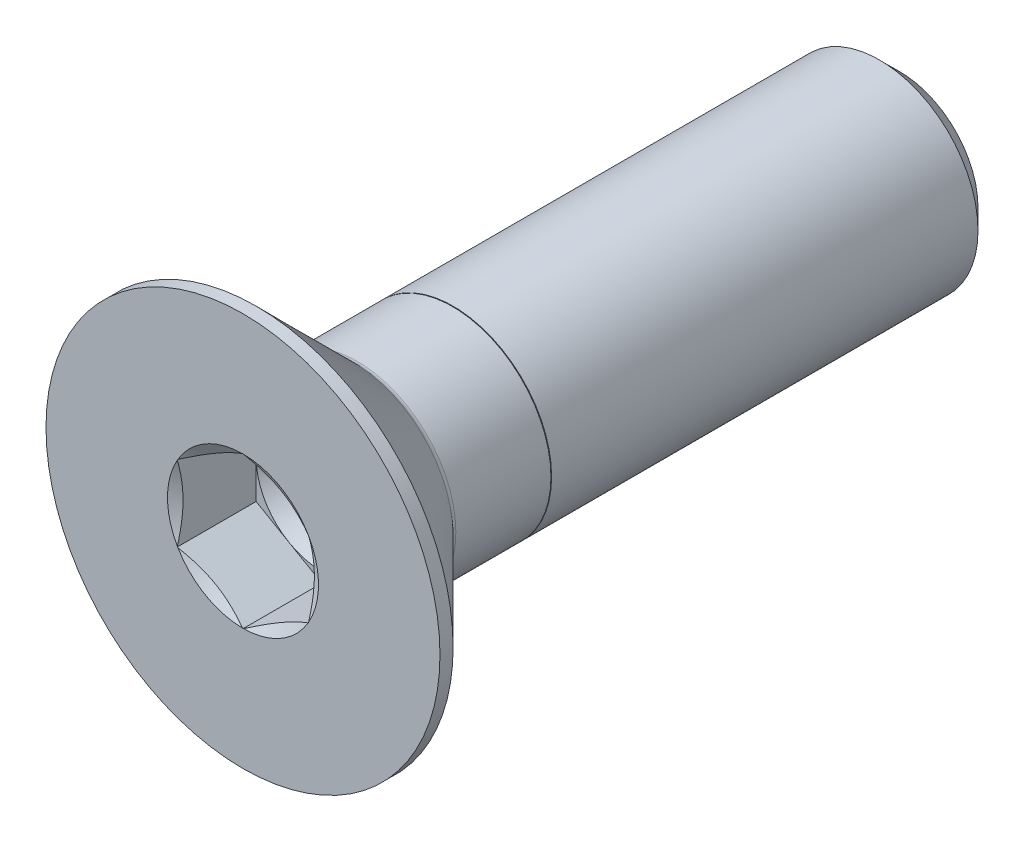
ISO-10303-21;
HEADER;
FILE_DESCRIPTION(('STEP AP214'),'2;1');
FILE_NAME('part.step','',(''),(''),'','','');
FILE_SCHEMA(('AUTOMOTIVE_DESIGN { 1 0 10303 214 1 1 1 1 }'));
ENDSEC;
DATA;
#1=APPLICATION_CONTEXT('core data for automotive mechanical design processes');
#2=APPLICATION_PROTOCOL_DEFINITION('international standard','automotive_design',2000,#1);
#3=PRODUCT_CONTEXT('',#1,'mechanical');
#4=PRODUCT('Part','Part','',(#3));
#5=PRODUCT_RELATED_PRODUCT_CATEGORY('part','',(#4));
#6=PRODUCT_DEFINITION_FORMATION('','',#4);
#7=PRODUCT_DEFINITION_CONTEXT('part definition',#1,'design');
#8=PRODUCT_DEFINITION('design','',#6,#7);
#9=PRODUCT_DEFINITION_SHAPE('','',#8);
#10=(LENGTH_UNIT() NAMED_UNIT(*) SI_UNIT(.MILLI.,.METRE.));
#11=(NAMED_UNIT(*) PLANE_ANGLE_UNIT() SI_UNIT($,.RADIAN.));
#12=(NAMED_UNIT(*) SI_UNIT($,.STERADIAN.) SOLID_ANGLE_UNIT());
#13=UNCERTAINTY_MEASURE_WITH_UNIT(LENGTH_MEASURE(1.E-05),#10,'distance_accuracy_value','');
#14=(GEOMETRIC_REPRESENTATION_CONTEXT(3) GLOBAL_UNCERTAINTY_ASSIGNED_CONTEXT((#13)) GLOBAL_UNIT_ASSIGNED_CONTEXT((#10,
#11,#12)) REPRESENTATION_CONTEXT('',''));
#15=CARTESIAN_POINT('',(0.,0.,0.));
#16=DIRECTION('',(0.,0.,1.));
#17=DIRECTION('',(1.,0.,0.));
#18=AXIS2_PLACEMENT_3D('',#15,#16,#17);
#19=CARTESIAN_POINT('',(0.,0.,1.25));
#20=DIRECTION('',(-1.,0.,0.));
#21=DIRECTION('',(0.,1.,0.));
#22=AXIS2_PLACEMENT_3D('',#19,#20,#21);
#23=SPHERICAL_SURFACE('',#22,1.25);
#24=CARTESIAN_POINT('',(-1.,0.,0.5));
#25=CARTESIAN_POINT('',(-0.999999918221247,-0.0281495245521416,0.5));
#26=CARTESIAN_POINT('',(-0.998810705131522,-0.0562856859630076,0.5));
#27=CARTESIAN_POINT('',(-0.994066576687322,-0.112356361404446,0.5));
#28=CARTESIAN_POINT('',(-0.990511783141581,-0.140290885742875,0.5));
#29=CARTESIAN_POINT('',(-0.976343201238138,-0.223384369013001,0.5));
#30=CARTESIAN_POINT('',(-0.962225042161326,-0.27798690137359,0.5));
#31=CARTESIAN_POINT('',(-0.925017617018385,-0.384066836858397,0.5));
#32=CARTESIAN_POINT('',(-0.901921159244324,-0.435541696368237,0.5));
#33=CARTESIAN_POINT('',(-0.847420007360541,-0.533893955867315,0.5));
#34=CARTESIAN_POINT('',(-0.816013396339763,-0.580770291686499,0.5));
#35=CARTESIAN_POINT('',(-0.742139756291213,-0.673099775905201,0.5));
#36=CARTESIAN_POINT('',(-0.698870858918713,-0.717918970422269,0.5));
#37=CARTESIAN_POINT('',(-0.628318945194335,-0.778580151446536,0.5));
#38=CARTESIAN_POINT('',(-0.603808211615082,-0.797736065958106,0.5));
#39=CARTESIAN_POINT('',(-0.553112162603095,-0.833685170069625,0.5));
#40=CARTESIAN_POINT('',(-0.526926888504461,-0.850478417956551,0.5));
#41=CARTESIAN_POINT('',(-0.5,-0.866025403784439,0.5));
#42=B_SPLINE_CURVE_WITH_KNOTS('',3,(#24,#25,#26,#27,#28,#29,#30,#31,#32,#33,#34,#35,#36,#37,#38,
#39,#40,#41),.UNSPECIFIED.,.F.,.F.,(4,2,2,2,2,2,2,2,4),(0.,0.0843969221510993,0.168789498862693,
0.337119537320777,0.505584688602224,0.674088733831015,0.859796862820128,0.953005960941174,
1.04621275919071),.UNSPECIFIED.);
#43=CARTESIAN_POINT('',(-1.,0.,0.5));
#44=VERTEX_POINT('',#43);
#45=CARTESIAN_POINT('',(-0.5,-0.866025403784438,0.5));
#46=VERTEX_POINT('',#45);
#47=EDGE_CURVE('E21',#44,#46,#42,.T.);
#48=ORIENTED_EDGE('',*,*,#47,.T.);
#49=CARTESIAN_POINT('',(-0.5,-0.866025403784439,0.5));
#50=CARTESIAN_POINT('',(-0.475621755744015,-0.880100095238032,0.5));
#51=CARTESIAN_POINT('',(-0.450660518652364,-0.89313828719725,0.5));
#52=CARTESIAN_POINT('',(-0.399729825090627,-0.917065089166476,0.5));
#53=CARTESIAN_POINT('',(-0.373760420598042,-0.927953809819869,0.5));
#54=CARTESIAN_POINT('',(-0.294715062245455,-0.95723019959095,0.500000000000001));
#55=CARTESIAN_POINT('',(-0.240368802571818,-0.972304781356058,0.500000000000003));
#56=CARTESIAN_POINT('',(-0.129897171038692,-0.993122173715266,0.500000000000003));
#57=CARTESIAN_POINT('',(-0.0737704061599044,-0.998857484300414,0.500000000000001));
#58=CARTESIAN_POINT('',(0.0386557250277878,-1.00083423198308,0.499999999999999));
#59=CARTESIAN_POINT('',(0.094955128193921,-0.997073476901905,0.500000000000001));
#60=CARTESIAN_POINT('',(0.211851627069907,-0.979261770059184,0.500000000000001));
#61=CARTESIAN_POINT('',(0.272300636785095,-0.964199402999392,0.5));
#62=CARTESIAN_POINT('',(0.360110717437866,-0.933430243940605,0.5));
#63=CARTESIAN_POINT('',(0.388955592827236,-0.921781283251364,0.5));
#64=CARTESIAN_POINT('',(0.445436454737096,-0.895851768991243,0.5));
#65=CARTESIAN_POINT('',(0.473072471068542,-0.881571280360231,0.500000000000001));
#66=CARTESIAN_POINT('',(0.500000000000001,-0.866025403784441,0.500000000000003));
#67=B_SPLINE_CURVE_WITH_KNOTS('',3,(#49,#50,#51,#52,#53,#54,#55,#56,#57,#58,#59,#60,#61,#62,#63,
#64,#65,#66),.UNSPECIFIED.,.F.,.F.,(4,2,2,2,2,2,2,2,4),(0.,0.0843969221510981,0.168789498862691,
0.337119537320774,0.50558468860222,0.674088733831011,0.859796862820125,0.953005960941173,
1.04621275919071),.UNSPECIFIED.);
#68=CARTESIAN_POINT('',(0.5,-0.866025403784439,0.5));
#69=VERTEX_POINT('',#68);
#70=EDGE_CURVE('E923',#46,#69,#67,.T.);
#71=ORIENTED_EDGE('',*,*,#70,.T.);
#72=CARTESIAN_POINT('',(0.5,-0.866025403784439,0.5));
#73=CARTESIAN_POINT('',(0.524378162477232,-0.851950570685891,0.5));
#74=CARTESIAN_POINT('',(0.548150186479159,-0.836852601234242,0.5));
#75=CARTESIAN_POINT('',(0.594336751596697,-0.80470872776203,0.5));
#76=CARTESIAN_POINT('',(0.61675136254354,-0.787662924076995,0.5));
#77=CARTESIAN_POINT('',(0.681628138992685,-0.73384583057795,0.5));
#78=CARTESIAN_POINT('',(0.721856239589512,-0.694317879982466,0.500000000000001));
#79=CARTESIAN_POINT('',(0.795120445979699,-0.609055336856868,0.500000000000001));
#80=CARTESIAN_POINT('',(0.828150753084425,-0.563315787932176,0.5));
#81=CARTESIAN_POINT('',(0.886075732388333,-0.466940276115767,0.5));
#82=CARTESIAN_POINT('',(0.910968524533688,-0.416303185215404,0.5));
#83=CARTESIAN_POINT('',(0.953991383361123,-0.306161994153981,0.5));
#84=CARTESIAN_POINT('',(0.971171495703811,-0.246280432577121,0.5));
#85=CARTESIAN_POINT('',(0.988429662632203,-0.154850092494069,0.5));
#86=CARTESIAN_POINT('',(0.992763804442319,-0.124045217293258,0.5));
#87=CARTESIAN_POINT('',(0.998548617340193,-0.0621665989216179,0.5));
#88=CARTESIAN_POINT('',(0.999999359573003,-0.0310928624036789,0.5));
#89=CARTESIAN_POINT('',(1.,0.,0.5));
#90=B_SPLINE_CURVE_WITH_KNOTS('',3,(#72,#73,#74,#75,#76,#77,#78,#79,#80,#81,#82,#83,#84,#85,#86,
#87,#88,#89),.UNSPECIFIED.,.F.,.F.,(4,2,2,2,2,2,2,2,4),(0.,0.0843969221510994,0.168789498862694,
0.337119537320778,0.505584688602225,0.674088733831016,0.859796862820128,0.953005960941174,
1.04621275919071),.UNSPECIFIED.);
#91=CARTESIAN_POINT('',(1.,0.,0.5));
#92=VERTEX_POINT('',#91);
#93=EDGE_CURVE('E928',#69,#92,#90,.T.);
#94=ORIENTED_EDGE('',*,*,#93,.T.);
#95=CARTESIAN_POINT('',(1.,0.,0.5));
#96=CARTESIAN_POINT('',(0.999999918221247,0.0281495245521418,0.5));
#97=CARTESIAN_POINT('',(0.998810705131522,0.0562856859630077,0.5));
#98=CARTESIAN_POINT('',(0.994066576687322,0.112356361404446,0.5));
#99=CARTESIAN_POINT('',(0.990511783141581,0.140290885742875,0.5));
#100=CARTESIAN_POINT('',(0.976343201238138,0.223384369013001,0.5));
#101=CARTESIAN_POINT('',(0.962225042161326,0.27798690137359,0.5));
#102=CARTESIAN_POINT('',(0.925017617018385,0.384066836858397,0.5));
#103=CARTESIAN_POINT('',(0.901921159244324,0.435541696368237,0.5));
#104=CARTESIAN_POINT('',(0.847420007360541,0.533893955867315,0.5));
#105=CARTESIAN_POINT('',(0.816013396339763,0.580770291686499,0.5));
#106=CARTESIAN_POINT('',(0.742139756291213,0.673099775905201,0.5));
#107=CARTESIAN_POINT('',(0.698870858918713,0.717918970422269,0.5));
#108=CARTESIAN_POINT('',(0.628318945194336,0.778580151446535,0.5));
#109=CARTESIAN_POINT('',(0.603808211615082,0.797736065958105,0.5));
#110=CARTESIAN_POINT('',(0.553112162603096,0.833685170069624,0.5));
#111=CARTESIAN_POINT('',(0.526926888504462,0.850478417956551,0.5));
#112=CARTESIAN_POINT('',(0.5,0.866025403784439,0.5));
#113=B_SPLINE_CURVE_WITH_KNOTS('',3,(#95,#96,#97,#98,#99,#100,#101,#102,#103,#104,#105,#106,
#107,#108,#109,#110,#111,#112),.UNSPECIFIED.,.F.,.F.,(4,2,2,2,2,2,2,2,4),(0.,0.0843969221510991,
0.168789498862693,0.337119537320777,0.505584688602224,0.674088733831015,0.859796862820127,
0.953005960941174,1.04621275919071),.UNSPECIFIED.);
#114=CARTESIAN_POINT('',(0.5,0.866025403784438,0.5));
#115=VERTEX_POINT('',#114);
#116=EDGE_CURVE('E384',#92,#115,#113,.T.);
#117=ORIENTED_EDGE('',*,*,#116,.T.);
#118=CARTESIAN_POINT('',(0.5,0.866025403784439,0.5));
#119=CARTESIAN_POINT('',(0.475621755744015,0.880100095238032,0.5));
#120=CARTESIAN_POINT('',(0.450660518652364,0.89313828719725,0.5));
#121=CARTESIAN_POINT('',(0.399729825090626,0.917065089166476,0.5));
#122=CARTESIAN_POINT('',(0.373760420598042,0.927953809819869,0.5));
#123=CARTESIAN_POINT('',(0.294715062245455,0.95723019959095,0.500000000000001));
#124=CARTESIAN_POINT('',(0.240368802571818,0.972304781356058,0.500000000000003));
#125=CARTESIAN_POINT('',(0.129897171038691,0.993122173715267,0.500000000000003));
#126=CARTESIAN_POINT('',(0.0737704061599038,0.998857484300414,0.500000000000001));
#127=CARTESIAN_POINT('',(-0.0386557250277884,1.00083423198308,0.499999999999999));
#128=CARTESIAN_POINT('',(-0.0949551281939217,0.997073476901905,0.500000000000001));
#129=CARTESIAN_POINT('',(-0.211851627069907,0.979261770059184,0.500000000000001));
#130=CARTESIAN_POINT('',(-0.272300636785095,0.964199402999392,0.5));
#131=CARTESIAN_POINT('',(-0.360110717437866,0.933430243940605,0.5));
#132=CARTESIAN_POINT('',(-0.388955592827235,0.921781283251364,0.5));
#133=CARTESIAN_POINT('',(-0.445436454737096,0.895851768991243,0.5));
#134=CARTESIAN_POINT('',(-0.473072471068541,0.881571280360231,0.500000000000001));
#135=CARTESIAN_POINT('',(-0.5,0.866025403784441,0.500000000000003));
#136=B_SPLINE_CURVE_WITH_KNOTS('',3,(#118,#119,#120,#121,#122,#123,#124,#125,#126,#127,#128,
#129,#130,#131,#132,#133,#134,#135),.UNSPECIFIED.,.F.,.F.,(4,2,2,2,2,2,2,2,4),(0.,
0.0843969221510984,0.168789498862692,0.337119537320774,0.505584688602221,0.674088733831012,
0.859796862820126,0.953005960941173,1.04621275919071),.UNSPECIFIED.);
#137=CARTESIAN_POINT('',(-0.499999999999999,0.866025403784439,0.5));
#138=VERTEX_POINT('',#137);
#139=EDGE_CURVE('E383',#115,#138,#136,.T.);
#140=ORIENTED_EDGE('',*,*,#139,.T.);
#141=CARTESIAN_POINT('',(-0.499999999999999,0.866025403784439,0.5));
#142=CARTESIAN_POINT('',(-0.524378162477231,0.851950570685891,0.5));
#143=CARTESIAN_POINT('',(-0.548150186479158,0.836852601234243,0.5));
#144=CARTESIAN_POINT('',(-0.594336751596696,0.804708727762031,0.5));
#145=CARTESIAN_POINT('',(-0.61675136254354,0.787662924076995,0.5));
#146=CARTESIAN_POINT('',(-0.681628138992685,0.73384583057795,0.5));
#147=CARTESIAN_POINT('',(-0.721856239589512,0.694317879982467,0.500000000000001));
#148=CARTESIAN_POINT('',(-0.795120445979698,0.609055336856869,0.500000000000001));
#149=CARTESIAN_POINT('',(-0.828150753084424,0.563315787932177,0.5));
#150=CARTESIAN_POINT('',(-0.886075732388333,0.466940276115768,0.5));
#151=CARTESIAN_POINT('',(-0.910968524533688,0.416303185215405,0.5));
#152=CARTESIAN_POINT('',(-0.953991383361123,0.306161994153982,0.5));
#153=CARTESIAN_POINT('',(-0.971171495703811,0.246280432577122,0.5));
#154=CARTESIAN_POINT('',(-0.988429662632203,0.15485009249407,0.5));
#155=CARTESIAN_POINT('',(-0.992763804442319,0.124045217293259,0.5));
#156=CARTESIAN_POINT('',(-0.998548617340193,0.0621665989216183,0.5));
#157=CARTESIAN_POINT('',(-0.999999359573004,0.0310928624036792,0.5));
#158=CARTESIAN_POINT('',(-1.,0.,0.5));
#159=B_SPLINE_CURVE_WITH_KNOTS('',3,(#141,#142,#143,#144,#145,#146,#147,#148,#149,#150,#151,
#152,#153,#154,#155,#156,#157,#158),.UNSPECIFIED.,.F.,.F.,(4,2,2,2,2,2,2,2,4),(0.,
0.0843969221510994,0.168789498862693,0.337119537320778,0.505584688602224,0.674088733831015,
0.859796862820128,0.953005960941175,1.04621275919071),.UNSPECIFIED.);
#160=EDGE_CURVE('E101',#138,#44,#159,.T.);
#161=ORIENTED_EDGE('',*,*,#160,.T.);
#162=EDGE_LOOP('',(#48,#71,#94,#117,#140,#161));
#163=FACE_BOUND('',#162,.T.);
#164=ADVANCED_FACE('F16',(#163),#23,.F.);
#165=CARTESIAN_POINT('',(1.,1.73205080756888,0.5));
#166=DIRECTION('',(0.,0.,-1.));
#167=DIRECTION('',(-1.,0.,0.));
#168=AXIS2_PLACEMENT_3D('',#165,#166,#167);
#169=PLANE('',#168);
#170=DIRECTION('',(0.,1.,0.));
#171=VECTOR('',#170,1.);
#172=CARTESIAN_POINT('',(-1.,-0.577350269189626,0.5));
#173=LINE('',#172,#171);
#174=CARTESIAN_POINT('',(-1.,-0.577350269189625,0.5));
#175=VERTEX_POINT('',#174);
#176=EDGE_CURVE('E108',#175,#44,#173,.T.);
#177=ORIENTED_EDGE('',*,*,#176,.F.);
#178=DIRECTION('',(-0.866025403784439,0.5,0.));
#179=VECTOR('',#178,1.);
#180=CARTESIAN_POINT('',(0.,-1.15470053837925,0.5));
#181=LINE('',#180,#179);
#182=EDGE_CURVE('E248',#46,#175,#181,.T.);
#183=ORIENTED_EDGE('',*,*,#182,.F.);
#184=ORIENTED_EDGE('',*,*,#47,.F.);
#185=EDGE_LOOP('',(#177,#183,#184));
#186=FACE_BOUND('',#185,.T.);
#187=ADVANCED_FACE('F645',(#186),#169,.F.);
#188=CARTESIAN_POINT('',(1.,1.73205080756888,0.5));
#189=DIRECTION('',(0.,0.,-1.));
#190=DIRECTION('',(-1.,0.,0.));
#191=AXIS2_PLACEMENT_3D('',#188,#189,#190);
#192=PLANE('',#191);
#193=DIRECTION('',(-0.866025403784439,0.5,0.));
#194=VECTOR('',#193,1.);
#195=CARTESIAN_POINT('',(0.,-1.15470053837925,0.5));
#196=LINE('',#195,#194);
#197=CARTESIAN_POINT('',(0.,-1.15470053837925,0.5));
#198=VERTEX_POINT('',#197);
#199=EDGE_CURVE('E283',#198,#46,#196,.T.);
#200=ORIENTED_EDGE('',*,*,#199,.F.);
#201=DIRECTION('',(-0.866025403784439,-0.5,0.));
#202=VECTOR('',#201,1.);
#203=CARTESIAN_POINT('',(1.,-0.577350269189626,0.5));
#204=LINE('',#203,#202);
#205=EDGE_CURVE('E241',#69,#198,#204,.T.);
#206=ORIENTED_EDGE('',*,*,#205,.F.);
#207=ORIENTED_EDGE('',*,*,#70,.F.);
#208=EDGE_LOOP('',(#200,#206,#207));
#209=FACE_BOUND('',#208,.T.);
#210=ADVANCED_FACE('F633',(#209),#192,.F.);
#211=CARTESIAN_POINT('',(1.,1.73205080756888,0.5));
#212=DIRECTION('',(0.,0.,-1.));
#213=DIRECTION('',(-1.,0.,0.));
#214=AXIS2_PLACEMENT_3D('',#211,#212,#213);
#215=PLANE('',#214);
#216=DIRECTION('',(-0.866025403784439,-0.5,0.));
#217=VECTOR('',#216,1.);
#218=CARTESIAN_POINT('',(1.,-0.577350269189626,0.5));
#219=LINE('',#218,#217);
#220=CARTESIAN_POINT('',(1.,-0.577350269189626,0.5));
#221=VERTEX_POINT('',#220);
#222=EDGE_CURVE('E274',#221,#69,#219,.T.);
#223=ORIENTED_EDGE('',*,*,#222,.F.);
#224=DIRECTION('',(0.,1.,0.));
#225=VECTOR('',#224,1.);
#226=CARTESIAN_POINT('',(1.,0.577350269189626,0.5));
#227=LINE('',#226,#225);
#228=EDGE_CURVE('E234',#92,#221,#227,.F.);
#229=ORIENTED_EDGE('',*,*,#228,.F.);
#230=ORIENTED_EDGE('',*,*,#93,.F.);
#231=EDGE_LOOP('',(#223,#229,#230));
#232=FACE_BOUND('',#231,.T.);
#233=ADVANCED_FACE('F622',(#232),#215,.F.);
#234=CARTESIAN_POINT('',(1.,1.73205080756888,0.5));
#235=DIRECTION('',(0.,0.,-1.));
#236=DIRECTION('',(-1.,0.,0.));
#237=AXIS2_PLACEMENT_3D('',#234,#235,#236);
#238=PLANE('',#237);
#239=DIRECTION('',(0.,1.,0.));
#240=VECTOR('',#239,1.);
#241=CARTESIAN_POINT('',(1.,0.577350269189626,0.5));
#242=LINE('',#241,#240);
#243=CARTESIAN_POINT('',(1.,0.577350269189624,0.5));
#244=VERTEX_POINT('',#243);
#245=EDGE_CURVE('E266',#244,#92,#242,.F.);
#246=ORIENTED_EDGE('',*,*,#245,.F.);
#247=DIRECTION('',(0.866025403784439,-0.5,0.));
#248=VECTOR('',#247,1.);
#249=CARTESIAN_POINT('',(0.,1.15470053837925,0.5));
#250=LINE('',#249,#248);
#251=EDGE_CURVE('E228',#115,#244,#250,.T.);
#252=ORIENTED_EDGE('',*,*,#251,.F.);
#253=ORIENTED_EDGE('',*,*,#116,.F.);
#254=EDGE_LOOP('',(#246,#252,#253));
#255=FACE_BOUND('',#254,.T.);
#256=ADVANCED_FACE('F394',(#255),#238,.F.);
#257=CARTESIAN_POINT('',(1.,1.73205080756888,0.5));
#258=DIRECTION('',(0.,0.,-1.));
#259=DIRECTION('',(-1.,0.,0.));
#260=AXIS2_PLACEMENT_3D('',#257,#258,#259);
#261=PLANE('',#260);
#262=DIRECTION('',(0.866025403784439,0.5,0.));
#263=VECTOR('',#262,1.);
#264=CARTESIAN_POINT('',(-1.,0.577350269189626,0.5));
#265=LINE('',#264,#263);
#266=CARTESIAN_POINT('',(-1.,0.577350269189626,0.5));
#267=VERTEX_POINT('',#266);
#268=EDGE_CURVE('E219',#267,#138,#265,.T.);
#269=ORIENTED_EDGE('',*,*,#268,.F.);
#270=DIRECTION('',(0.,1.,0.));
#271=VECTOR('',#270,1.);
#272=CARTESIAN_POINT('',(-1.,-0.577350269189626,0.5));
#273=LINE('',#272,#271);
#274=EDGE_CURVE('E261',#44,#267,#273,.T.);
#275=ORIENTED_EDGE('',*,*,#274,.F.);
#276=ORIENTED_EDGE('',*,*,#160,.F.);
#277=EDGE_LOOP('',(#269,#275,#276));
#278=FACE_BOUND('',#277,.T.);
#279=ADVANCED_FACE('F382',(#278),#261,.F.);
#280=CARTESIAN_POINT('',(1.,1.73205080756888,0.5));
#281=DIRECTION('',(0.,0.,-1.));
#282=DIRECTION('',(-1.,0.,0.));
#283=AXIS2_PLACEMENT_3D('',#280,#281,#282);
#284=PLANE('',#283);
#285=DIRECTION('',(0.866025403784439,-0.5,0.));
#286=VECTOR('',#285,1.);
#287=CARTESIAN_POINT('',(0.,1.15470053837925,0.5));
#288=LINE('',#287,#286);
#289=CARTESIAN_POINT('',(0.,1.15470053837925,0.5));
#290=VERTEX_POINT('',#289);
#291=EDGE_CURVE('E251',#290,#115,#288,.T.);
#292=ORIENTED_EDGE('',*,*,#291,.F.);
#293=DIRECTION('',(0.866025403784439,0.5,0.));
#294=VECTOR('',#293,1.);
#295=CARTESIAN_POINT('',(-1.,0.577350269189626,0.5));
#296=LINE('',#295,#294);
#297=EDGE_CURVE('E156',#138,#290,#296,.T.);
#298=ORIENTED_EDGE('',*,*,#297,.F.);
#299=ORIENTED_EDGE('',*,*,#139,.F.);
#300=EDGE_LOOP('',(#292,#298,#299));
#301=FACE_BOUND('',#300,.T.);
#302=ADVANCED_FACE('F388',(#301),#284,.F.);
#303=CARTESIAN_POINT('',(0.,0.,1.70000000008486));
#304=DIRECTION('',(0.,0.,1.));
#305=DIRECTION('',(1.,0.,0.));
#306=AXIS2_PLACEMENT_3D('',#303,#304,#305);
#307=CONICAL_SURFACE('',#306,1.15000000010923,1.04719755122045);
#308=CARTESIAN_POINT('',(-1.,0.567890834581807,1.7000000000223));
#309=CARTESIAN_POINT('',(-1.,0.517307283570297,1.68557228640608));
#310=CARTESIAN_POINT('',(-1.,0.466286843365992,1.67248535056143));
#311=CARTESIAN_POINT('',(-1.,0.363375742919932,1.6497210302096));
#312=CARTESIAN_POINT('',(-1.,0.311483350352291,1.64005156082042));
#313=CARTESIAN_POINT('',(-1.,0.208337012798557,1.62510771139287));
#314=CARTESIAN_POINT('',(-1.,0.157098286449418,1.61973205109716));
#315=CARTESIAN_POINT('',(-1.,0.0543986608337356,1.61350127394018));
#316=CARTESIAN_POINT('',(-1.,0.00293809753266549,1.61264079808044));
#317=CARTESIAN_POINT('',(-1.,-0.0919765232483634,1.61528923603533));
#318=CARTESIAN_POINT('',(-1.,-0.135450325752679,1.61814945267443));
#319=CARTESIAN_POINT('',(-1.,-0.22208711691931,1.62695146739236));
#320=CARTESIAN_POINT('',(-1.,-0.26525005663329,1.6328937404608));
#321=CARTESIAN_POINT('',(-1.,-0.352029208151982,1.6476476866478));
#322=CARTESIAN_POINT('',(-1.,-0.395635111577935,1.65651849403495));
#323=CARTESIAN_POINT('',(-1.,-0.482222992957887,1.67661181673736));
#324=CARTESIAN_POINT('',(-1.,-0.525205953111748,1.68783006810734));
#325=CARTESIAN_POINT('',(-1.,-0.567890834581807,1.7000000000223));
#326=B_SPLINE_CURVE_WITH_KNOTS('',3,(#308,#309,#310,#311,#312,#313,#314,#315,#316,#317,#318,
#319,#320,#321,#322,#323,#324,#325),.UNSPECIFIED.,.F.,.F.,(4,2,2,2,2,2,2,2,4),(0.,
0.157864083189179,0.316091432118757,0.470466224218563,0.624657749893881,0.755245826329913,
0.885854034266176,1.01927976317709,1.15246520657173),.UNSPECIFIED.);
#327=CARTESIAN_POINT('',(-1.,0.56789083463396,1.70000000003717));
#328=VERTEX_POINT('',#327);
#329=CARTESIAN_POINT('',(-1.,-0.56789083463396,1.70000000003717));
#330=VERTEX_POINT('',#329);
#331=EDGE_CURVE('E293',#328,#330,#326,.T.);
#332=ORIENTED_EDGE('',*,*,#331,.F.);
#333=CARTESIAN_POINT('',(0.,0.,1.70000000005204));
#334=DIRECTION('',(0.,0.,1.));
#335=DIRECTION('',(1.,0.,0.));
#336=AXIS2_PLACEMENT_3D('',#333,#334,#335);
#337=CIRCLE('',#336,1.15000000005239);
#338=EDGE_CURVE('E209',#328,#330,#337,.T.);
#339=ORIENTED_EDGE('',*,*,#338,.T.);
#340=EDGE_LOOP('',(#332,#339));
#341=FACE_BOUND('',#340,.T.);
#342=ADVANCED_FACE('F580',(#341),#307,.F.);
#343=CARTESIAN_POINT('',(-1.,-0.577350269189626,0.5));
#344=DIRECTION('',(1.,0.,0.));
#345=DIRECTION('',(0.,0.,-1.));
#346=AXIS2_PLACEMENT_3D('',#343,#344,#345);
#347=PLANE('',#346);
#348=ORIENTED_EDGE('',*,*,#274,.T.);
#349=DIRECTION('',(0.,0.,1.));
#350=VECTOR('',#349,1.);
#351=CARTESIAN_POINT('',(-1.,0.577350269189626,0.5));
#352=LINE('',#351,#350);
#353=CARTESIAN_POINT('',(-1.,0.577350269189626,1.7));
#354=VERTEX_POINT('',#353);
#355=EDGE_CURVE('E216',#354,#267,#352,.F.);
#356=ORIENTED_EDGE('',*,*,#355,.F.);
#357=DIRECTION('',(0.,1.,0.));
#358=VECTOR('',#357,1.);
#359=CARTESIAN_POINT('',(-1.,0.,1.7));
#360=LINE('',#359,#358);
#361=EDGE_CURVE('E157',#354,#328,#360,.F.);
#362=ORIENTED_EDGE('',*,*,#361,.T.);
#363=ORIENTED_EDGE('',*,*,#331,.T.);
#364=DIRECTION('',(0.,1.,0.));
#365=VECTOR('',#364,1.);
#366=CARTESIAN_POINT('',(-1.,0.,1.7));
#367=LINE('',#366,#365);
#368=CARTESIAN_POINT('',(-1.,-0.577350269189626,1.7));
#369=VERTEX_POINT('',#368);
#370=EDGE_CURVE('E205',#330,#369,#367,.F.);
#371=ORIENTED_EDGE('',*,*,#370,.T.);
#372=DIRECTION('',(0.,0.,1.));
#373=VECTOR('',#372,1.);
#374=CARTESIAN_POINT('',(-1.,-0.577350269189625,0.5));
#375=LINE('',#374,#373);
#376=EDGE_CURVE('E244',#175,#369,#375,.T.);
#377=ORIENTED_EDGE('',*,*,#376,.F.);
#378=ORIENTED_EDGE('',*,*,#176,.T.);
#379=EDGE_LOOP('',(#348,#356,#362,#363,#371,#377,#378));
#380=FACE_BOUND('',#379,.T.);
#381=ADVANCED_FACE('F378',(#380),#347,.T.);
#382=CARTESIAN_POINT('',(0.,0.,1.70000000008486));
#383=DIRECTION('',(0.,0.,1.));
#384=DIRECTION('',(1.,0.,0.));
#385=AXIS2_PLACEMENT_3D('',#382,#383,#384);
#386=CONICAL_SURFACE('',#385,1.15000000010923,1.04719755122801);
#387=CARTESIAN_POINT('',(-0.991807889324193,-0.582079986493534,1.7000000000223));
#388=CARTESIAN_POINT('',(-0.948001249134668,-0.607371761999248,1.68557228640635));
#389=CARTESIAN_POINT('',(-0.903816251805558,-0.632881982101353,1.67248535056195));
#390=CARTESIAN_POINT('',(-0.814692624488052,-0.684337532324271,1.64972103021056));
#391=CARTESIAN_POINT('',(-0.769752494261432,-0.710283728608027,1.64005156082156));
#392=CARTESIAN_POINT('',(-0.680425145632776,-0.761856897384777,1.62510771139427));
#393=CARTESIAN_POINT('',(-0.636051106956952,-0.787476260559295,1.61973205109864));
#394=CARTESIAN_POINT('',(-0.547110622214805,-0.838826073367029,1.61350127394173));
#395=CARTESIAN_POINT('',(-0.502544467103116,-0.864556355017509,1.61264079808197));
#396=CARTESIAN_POINT('',(-0.420345994316184,-0.912013665408021,1.61528923603674));
#397=CARTESIAN_POINT('',(-0.382696576948251,-0.933750566660229,1.61814945267577));
#398=CARTESIAN_POINT('',(-0.307666914895396,-0.977068962243652,1.62695146739352));
#399=CARTESIAN_POINT('',(-0.270286712600976,-0.998650432100698,1.63289374046186));
#400=CARTESIAN_POINT('',(-0.195133762866746,-1.04204000786015,1.6476476866486));
#401=CARTESIAN_POINT('',(-0.157369942744814,-1.06384295957318,1.65651849403561));
#402=CARTESIAN_POINT('',(-0.0823826378097128,-1.10713690026326,1.6766118167377));
#403=CARTESIAN_POINT('',(-0.045158302386513,-1.12862838034025,1.68783006810752));
#404=CARTESIAN_POINT('',(-0.00819211067580559,-1.14997082107534,1.7000000000223));
#405=B_SPLINE_CURVE_WITH_KNOTS('',3,(#387,#388,#389,#390,#391,#392,#393,#394,#395,#396,#397,
#398,#399,#400,#401,#402,#403,#404),.UNSPECIFIED.,.F.,.F.,(4,2,2,2,2,2,2,2,4),(0.,
0.15786408318872,0.316091432117823,0.470466224217302,0.624657749892301,0.755245826328625,
0.885854034265182,1.01927976317631,1.15246520657116),.UNSPECIFIED.);
#406=CARTESIAN_POINT('',(-0.991807889369357,-0.582079986467459,1.70000000003717));
#407=VERTEX_POINT('',#406);
#408=CARTESIAN_POINT('',(-0.00819211063063935,-1.14997082110142,1.70000000003717));
#409=VERTEX_POINT('',#408);
#410=EDGE_CURVE('E263',#407,#409,#405,.T.);
#411=ORIENTED_EDGE('',*,*,#410,.F.);
#412=CARTESIAN_POINT('',(0.,0.,1.70000000005204));
#413=DIRECTION('',(0.,0.,1.));
#414=DIRECTION('',(1.,0.,0.));
#415=AXIS2_PLACEMENT_3D('',#412,#413,#414);
#416=CIRCLE('',#415,1.15000000005239);
#417=EDGE_CURVE('E199',#407,#409,#416,.T.);
#418=ORIENTED_EDGE('',*,*,#417,.T.);
#419=EDGE_LOOP('',(#411,#418));
#420=FACE_BOUND('',#419,.T.);
#421=ADVANCED_FACE('F557',(#420),#386,.F.);
#422=CARTESIAN_POINT('',(0.,-1.15470053837925,0.5));
#423=DIRECTION('',(0.5,0.866025403784439,0.));
#424=DIRECTION('',(-0.866025403784439,0.5,0.));
#425=AXIS2_PLACEMENT_3D('',#422,#423,#424);
#426=PLANE('',#425);
#427=ORIENTED_EDGE('',*,*,#182,.T.);
#428=ORIENTED_EDGE('',*,*,#376,.T.);
#429=DIRECTION('',(0.866025403784398,-0.500000000000071,0.));
#430=VECTOR('',#429,1.);
#431=CARTESIAN_POINT('',(-1.,-0.577350269189626,1.7));
#432=LINE('',#431,#430);
#433=EDGE_CURVE('E202',#369,#407,#432,.T.);
#434=ORIENTED_EDGE('',*,*,#433,.T.);
#435=ORIENTED_EDGE('',*,*,#410,.T.);
#436=DIRECTION('',(0.866025403784379,-0.500000000000104,0.));
#437=VECTOR('',#436,1.);
#438=CARTESIAN_POINT('',(-0.00819211067734985,-1.14997082107445,1.7));
#439=LINE('',#438,#437);
#440=CARTESIAN_POINT('',(0.,-1.15470053837925,1.7));
#441=VERTEX_POINT('',#440);
#442=EDGE_CURVE('E195',#409,#441,#439,.T.);
#443=ORIENTED_EDGE('',*,*,#442,.T.);
#444=DIRECTION('',(0.,0.,1.));
#445=VECTOR('',#444,1.);
#446=CARTESIAN_POINT('',(0.,-1.15470053837925,0.5));
#447=LINE('',#446,#445);
#448=EDGE_CURVE('E237',#198,#441,#447,.T.);
#449=ORIENTED_EDGE('',*,*,#448,.F.);
#450=ORIENTED_EDGE('',*,*,#199,.T.);
#451=EDGE_LOOP('',(#427,#428,#434,#435,#443,#449,#450));
#452=FACE_BOUND('',#451,.T.);
#453=ADVANCED_FACE('F545',(#452),#426,.T.);
#454=CARTESIAN_POINT('',(0.,0.,1.70000000008486));
#455=DIRECTION('',(0.,0.,1.));
#456=DIRECTION('',(1.,0.,0.));
#457=AXIS2_PLACEMENT_3D('',#454,#455,#456);
#458=CONICAL_SURFACE('',#457,1.15000000010923,1.04719755113992);
#459=CARTESIAN_POINT('',(0.00819211067580504,-1.14997082107534,1.7000000000223));
#460=CARTESIAN_POINT('',(0.0519987508661326,-1.12467904556917,1.68557228640316));
#461=CARTESIAN_POINT('',(0.0961837481962076,-1.0991688254665,1.67248535055583));
#462=CARTESIAN_POINT('',(0.185307375515979,-1.04771327524228,1.64972103019938));
#463=CARTESIAN_POINT('',(0.230247505743901,-1.02176707895777,1.64005156080826));
#464=CARTESIAN_POINT('',(0.319574854374916,-0.970193910179658,1.62510771137795));
#465=CARTESIAN_POINT('',(0.363948893051787,-0.944574547004536,1.61973205108137));
#466=CARTESIAN_POINT('',(0.452889377796087,-0.893224734195559,1.6135012739237));
#467=CARTESIAN_POINT('',(0.497455532908883,-0.86749445254444,1.61264079806414));
#468=CARTESIAN_POINT('',(0.579654005695882,-0.820037142153889,1.61528923602027));
#469=CARTESIAN_POINT('',(0.617303423062794,-0.79830024090227,1.61814945266014));
#470=CARTESIAN_POINT('',(0.692333085113498,-0.754981845320089,1.62695146737998));
#471=CARTESIAN_POINT('',(0.729713287406789,-0.733400375463695,1.63289374044957));
#472=CARTESIAN_POINT('',(0.804866237138894,-0.69001079970547,1.64764768663923));
#473=CARTESIAN_POINT('',(0.842630057259824,-0.668207847993022,1.65651849402793));
#474=CARTESIAN_POINT('',(0.917617362192737,-0.624913907304201,1.67661181673368));
#475=CARTESIAN_POINT('',(0.954841697614751,-0.603422427227896,1.68783006810546));
#476=CARTESIAN_POINT('',(0.991807889324193,-0.582079986493534,1.7000000000223));
#477=B_SPLINE_CURVE_WITH_KNOTS('',3,(#459,#460,#461,#462,#463,#464,#465,#466,#467,#468,#469,
#470,#471,#472,#473,#474,#475,#476),.UNSPECIFIED.,.F.,.F.,(4,2,2,2,2,2,2,2,4),(0.,
0.157864083194066,0.316091432128706,0.470466224232002,0.624657749910719,0.755245826343643,
0.885854034276807,1.01927976318552,1.15246520657787),.UNSPECIFIED.);
#478=CARTESIAN_POINT('',(0.00819211063063814,-1.14997082110142,1.70000000003717));
#479=VERTEX_POINT('',#478);
#480=CARTESIAN_POINT('',(0.991807889369358,-0.582079986467459,1.70000000003717));
#481=VERTEX_POINT('',#480);
#482=EDGE_CURVE('E247',#479,#481,#477,.T.);
#483=ORIENTED_EDGE('',*,*,#482,.F.);
#484=CARTESIAN_POINT('',(0.,0.,1.70000000005204));
#485=DIRECTION('',(0.,0.,1.));
#486=DIRECTION('',(1.,0.,0.));
#487=AXIS2_PLACEMENT_3D('',#484,#485,#486);
#488=CIRCLE('',#487,1.15000000005239);
#489=EDGE_CURVE('E189',#479,#481,#488,.T.);
#490=ORIENTED_EDGE('',*,*,#489,.T.);
#491=EDGE_LOOP('',(#483,#490));
#492=FACE_BOUND('',#491,.T.);
#493=ADVANCED_FACE('F533',(#492),#458,.F.);
#494=CARTESIAN_POINT('',(1.,-0.577350269189626,0.5));
#495=DIRECTION('',(-0.5,0.866025403784439,0.));
#496=DIRECTION('',(-0.866025403784439,-0.5,0.));
#497=AXIS2_PLACEMENT_3D('',#494,#495,#496);
#498=PLANE('',#497);
#499=ORIENTED_EDGE('',*,*,#205,.T.);
#500=ORIENTED_EDGE('',*,*,#448,.T.);
#501=DIRECTION('',(0.866025403784379,0.500000000000104,0.));
#502=VECTOR('',#501,1.);
#503=CARTESIAN_POINT('',(0.,-1.15470053837925,1.7));
#504=LINE('',#503,#502);
#505=EDGE_CURVE('E192',#441,#479,#504,.T.);
#506=ORIENTED_EDGE('',*,*,#505,.T.);
#507=ORIENTED_EDGE('',*,*,#482,.T.);
#508=DIRECTION('',(0.866025403784431,0.500000000000013,0.));
#509=VECTOR('',#508,1.);
#510=CARTESIAN_POINT('',(0.991807889322649,-0.582079986494426,1.7));
#511=LINE('',#510,#509);
#512=CARTESIAN_POINT('',(1.,-0.577350269189626,1.7));
#513=VERTEX_POINT('',#512);
#514=EDGE_CURVE('E185',#481,#513,#511,.T.);
#515=ORIENTED_EDGE('',*,*,#514,.T.);
#516=DIRECTION('',(0.,0.,1.));
#517=VECTOR('',#516,1.);
#518=CARTESIAN_POINT('',(1.,-0.577350269189626,0.5));
#519=LINE('',#518,#517);
#520=EDGE_CURVE('E231',#221,#513,#519,.T.);
#521=ORIENTED_EDGE('',*,*,#520,.F.);
#522=ORIENTED_EDGE('',*,*,#222,.T.);
#523=EDGE_LOOP('',(#499,#500,#506,#507,#515,#521,#522));
#524=FACE_BOUND('',#523,.T.);
#525=ADVANCED_FACE('F521',(#524),#498,.T.);
#526=CARTESIAN_POINT('',(0.,0.,1.70000000008486));
#527=DIRECTION('',(0.,0.,1.));
#528=DIRECTION('',(1.,0.,0.));
#529=AXIS2_PLACEMENT_3D('',#526,#527,#528);
#530=CONICAL_SURFACE('',#529,1.15000000010923,1.04719755115654);
#531=CARTESIAN_POINT('',(1.,-0.567890834581809,1.7000000000223));
#532=CARTESIAN_POINT('',(1.,-0.517307283569627,1.68557228640376));
#533=CARTESIAN_POINT('',(1.,-0.466286843364514,1.67248535055698));
#534=CARTESIAN_POINT('',(1.,-0.363375742916556,1.64972103020149));
#535=CARTESIAN_POINT('',(1.,-0.311483350347824,1.64005156081077));
#536=CARTESIAN_POINT('',(1.,-0.208337012792114,1.62510771138103));
#537=CARTESIAN_POINT('',(1.,-0.157098286442097,1.61973205108463));
#538=CARTESIAN_POINT('',(1.,-0.0543986608246117,1.6135012739271));
#539=CARTESIAN_POINT('',(1.,-0.00293809752261503,1.6126407980675));
#540=CARTESIAN_POINT('',(1.,0.0919765232584707,1.61528923602338));
#541=CARTESIAN_POINT('',(1.,0.135450325761931,1.61814945266309));
#542=CARTESIAN_POINT('',(1.,0.222087116926761,1.62695146738253));
#543=CARTESIAN_POINT('',(1.,0.265250056639795,1.63289374045189));
#544=CARTESIAN_POINT('',(1.,0.352029208156709,1.647647686641));
#545=CARTESIAN_POINT('',(1.,0.395635111581823,1.65651849402938));
#546=CARTESIAN_POINT('',(1.,0.482222992959942,1.67661181673444));
#547=CARTESIAN_POINT('',(1.,0.52520595311281,1.68783006810585));
#548=CARTESIAN_POINT('',(1.,0.567890834581809,1.7000000000223));
#549=B_SPLINE_CURVE_WITH_KNOTS('',3,(#531,#532,#533,#534,#535,#536,#537,#538,#539,#540,#541,
#542,#543,#544,#545,#546,#547,#548),.UNSPECIFIED.,.F.,.F.,(4,2,2,2,2,2,2,2,4),(0.,
0.157864083193057,0.316091432126652,0.470466224229228,0.624657749907243,0.755245826340808,
0.885854034274612,1.01927976318378,1.1524652065766),.UNSPECIFIED.);
#550=CARTESIAN_POINT('',(1.,-0.567890834633961,1.70000000003717));
#551=VERTEX_POINT('',#550);
#552=CARTESIAN_POINT('',(1.,0.567890834633961,1.70000000003717));
#553=VERTEX_POINT('',#552);
#554=EDGE_CURVE('E240',#551,#553,#549,.T.);
#555=ORIENTED_EDGE('',*,*,#554,.F.);
#556=CARTESIAN_POINT('',(0.,0.,1.70000000005204));
#557=DIRECTION('',(0.,0.,1.));
#558=DIRECTION('',(1.,0.,0.));
#559=AXIS2_PLACEMENT_3D('',#556,#557,#558);
#560=CIRCLE('',#559,1.15000000005239);
#561=EDGE_CURVE('E179',#551,#553,#560,.T.);
#562=ORIENTED_EDGE('',*,*,#561,.T.);
#563=EDGE_LOOP('',(#555,#562));
#564=FACE_BOUND('',#563,.T.);
#565=ADVANCED_FACE('F410',(#564),#530,.F.);
#566=CARTESIAN_POINT('',(1.,0.577350269189626,0.5));
#567=DIRECTION('',(-1.,0.,0.));
#568=DIRECTION('',(0.,0.,1.));
#569=AXIS2_PLACEMENT_3D('',#566,#567,#568);
#570=PLANE('',#569);
#571=ORIENTED_EDGE('',*,*,#228,.T.);
#572=ORIENTED_EDGE('',*,*,#520,.T.);
#573=DIRECTION('',(0.,1.,0.));
#574=VECTOR('',#573,1.);
#575=CARTESIAN_POINT('',(1.,0.,1.7));
#576=LINE('',#575,#574);
#577=EDGE_CURVE('E182',#513,#551,#576,.T.);
#578=ORIENTED_EDGE('',*,*,#577,.T.);
#579=ORIENTED_EDGE('',*,*,#554,.T.);
#580=DIRECTION('',(0.,1.,0.));
#581=VECTOR('',#580,1.);
#582=CARTESIAN_POINT('',(1.,0.,1.7));
#583=LINE('',#582,#581);
#584=CARTESIAN_POINT('',(1.,0.577350269189626,1.7));
#585=VERTEX_POINT('',#584);
#586=EDGE_CURVE('E175',#553,#585,#583,.T.);
#587=ORIENTED_EDGE('',*,*,#586,.T.);
#588=DIRECTION('',(0.,0.,1.));
#589=VECTOR('',#588,1.);
#590=CARTESIAN_POINT('',(0.999999999999999,0.577350269189624,0.5));
#591=LINE('',#590,#589);
#592=EDGE_CURVE('E225',#244,#585,#591,.T.);
#593=ORIENTED_EDGE('',*,*,#592,.F.);
#594=ORIENTED_EDGE('',*,*,#245,.T.);
#595=EDGE_LOOP('',(#571,#572,#578,#579,#587,#593,#594));
#596=FACE_BOUND('',#595,.T.);
#597=ADVANCED_FACE('F397',(#596),#570,.T.);
#598=CARTESIAN_POINT('',(0.,0.,1.70000000008486));
#599=DIRECTION('',(0.,0.,1.));
#600=DIRECTION('',(1.,0.,0.));
#601=AXIS2_PLACEMENT_3D('',#598,#599,#600);
#602=CONICAL_SURFACE('',#601,1.15000000010923,1.04719755122801);
#603=CARTESIAN_POINT('',(0.991807889324194,0.582079986493532,1.7000000000223));
#604=CARTESIAN_POINT('',(0.948001249134669,0.607371761999247,1.68557228640635));
#605=CARTESIAN_POINT('',(0.903816251805559,0.632881982101351,1.67248535056195));
#606=CARTESIAN_POINT('',(0.814692624488054,0.684337532324269,1.64972103021056));
#607=CARTESIAN_POINT('',(0.769752494261433,0.710283728608025,1.64005156082156));
#608=CARTESIAN_POINT('',(0.680425145632778,0.761856897384775,1.62510771139427));
#609=CARTESIAN_POINT('',(0.636051106956953,0.787476260559293,1.61973205109864));
#610=CARTESIAN_POINT('',(0.547110622214806,0.838826073367028,1.61350127394173));
#611=CARTESIAN_POINT('',(0.502544467103117,0.864556355017508,1.61264079808197));
#612=CARTESIAN_POINT('',(0.420345994316185,0.912013665408019,1.61528923603674));
#613=CARTESIAN_POINT('',(0.382696576948252,0.933750566660228,1.61814945267577));
#614=CARTESIAN_POINT('',(0.307666914895396,0.977068962243651,1.62695146739352));
#615=CARTESIAN_POINT('',(0.270286712600976,0.998650432100697,1.63289374046186));
#616=CARTESIAN_POINT('',(0.195133762866746,1.04204000786015,1.6476476866486));
#617=CARTESIAN_POINT('',(0.157369942744813,1.06384295957318,1.65651849403561));
#618=CARTESIAN_POINT('',(0.0823826378097116,1.10713690026326,1.6766118167377));
#619=CARTESIAN_POINT('',(0.0451583023865116,1.12862838034025,1.68783006810752));
#620=CARTESIAN_POINT('',(0.00819211067580383,1.14997082107534,1.7000000000223));
#621=B_SPLINE_CURVE_WITH_KNOTS('',3,(#603,#604,#605,#606,#607,#608,#609,#610,#611,#612,#613,
#614,#615,#616,#617,#618,#619,#620),.UNSPECIFIED.,.F.,.F.,(4,2,2,2,2,2,2,2,4),(0.,
0.15786408318872,0.316091432117823,0.470466224217302,0.624657749892301,0.755245826328626,
0.885854034265183,1.01927976317631,1.15246520657116),.UNSPECIFIED.);
#622=CARTESIAN_POINT('',(0.991807889369358,0.582079986467457,1.70000000003717));
#623=VERTEX_POINT('',#622);
#624=CARTESIAN_POINT('',(0.00819211063063755,1.14997082110142,1.70000000003717));
#625=VERTEX_POINT('',#624);
#626=EDGE_CURVE('E144',#623,#625,#621,.T.);
#627=ORIENTED_EDGE('',*,*,#626,.F.);
#628=CARTESIAN_POINT('',(0.,0.,1.70000000005204));
#629=DIRECTION('',(0.,0.,1.));
#630=DIRECTION('',(1.,0.,0.));
#631=AXIS2_PLACEMENT_3D('',#628,#629,#630);
#632=CIRCLE('',#631,1.15000000005239);
#633=EDGE_CURVE('E149',#623,#625,#632,.T.);
#634=ORIENTED_EDGE('',*,*,#633,.T.);
#635=EDGE_LOOP('',(#627,#634));
#636=FACE_BOUND('',#635,.T.);
#637=ADVANCED_FACE('F403',(#636),#602,.F.);
#638=CARTESIAN_POINT('',(0.,1.15470053837925,0.5));
#639=DIRECTION('',(-0.5,-0.866025403784439,0.));
#640=DIRECTION('',(0.866025403784439,-0.5,0.));
#641=AXIS2_PLACEMENT_3D('',#638,#639,#640);
#642=PLANE('',#641);
#643=ORIENTED_EDGE('',*,*,#251,.T.);
#644=ORIENTED_EDGE('',*,*,#592,.T.);
#645=DIRECTION('',(-0.866025403784441,0.499999999999995,0.));
#646=VECTOR('',#645,1.);
#647=CARTESIAN_POINT('',(1.,0.577350269189626,1.7));
#648=LINE('',#647,#646);
#649=EDGE_CURVE('E173',#585,#623,#648,.T.);
#650=ORIENTED_EDGE('',*,*,#649,.T.);
#651=ORIENTED_EDGE('',*,*,#626,.T.);
#652=DIRECTION('',(-0.866025403784379,0.500000000000104,0.));
#653=VECTOR('',#652,1.);
#654=CARTESIAN_POINT('',(0.00819211067734811,1.14997082107445,1.7));
#655=LINE('',#654,#653);
#656=CARTESIAN_POINT('',(0.,1.15470053837925,1.7));
#657=VERTEX_POINT('',#656);
#658=EDGE_CURVE('E136',#625,#657,#655,.T.);
#659=ORIENTED_EDGE('',*,*,#658,.T.);
#660=DIRECTION('',(0.,0.,1.));
#661=VECTOR('',#660,1.);
#662=CARTESIAN_POINT('',(0.,1.15470053837925,0.5));
#663=LINE('',#662,#661);
#664=EDGE_CURVE('E141',#290,#657,#663,.T.);
#665=ORIENTED_EDGE('',*,*,#664,.F.);
#666=ORIENTED_EDGE('',*,*,#291,.T.);
#667=EDGE_LOOP('',(#643,#644,#650,#651,#659,#665,#666));
#668=FACE_BOUND('',#667,.T.);
#669=ADVANCED_FACE('F139',(#668),#642,.T.);
#670=CARTESIAN_POINT('',(0.,0.,1.70000000008486));
#671=DIRECTION('',(0.,0.,1.));
#672=DIRECTION('',(1.,0.,0.));
#673=AXIS2_PLACEMENT_3D('',#670,#671,#672);
#674=CONICAL_SURFACE('',#673,1.15000000010923,1.04719755113992);
#675=CARTESIAN_POINT('',(-0.00819211067580632,1.14997082107534,1.7000000000223));
#676=CARTESIAN_POINT('',(-0.0519987508661339,1.12467904556916,1.68557228640316));
#677=CARTESIAN_POINT('',(-0.096183748196209,1.0991688254665,1.67248535055583));
#678=CARTESIAN_POINT('',(-0.18530737551598,1.04771327524228,1.64972103019938));
#679=CARTESIAN_POINT('',(-0.230247505743902,1.02176707895777,1.64005156080826));
#680=CARTESIAN_POINT('',(-0.319574854374917,0.970193910179658,1.62510771137795));
#681=CARTESIAN_POINT('',(-0.363948893051788,0.944574547004535,1.61973205108137));
#682=CARTESIAN_POINT('',(-0.452889377796088,0.893224734195558,1.6135012739237));
#683=CARTESIAN_POINT('',(-0.497455532908884,0.867494452544439,1.61264079806414));
#684=CARTESIAN_POINT('',(-0.579654005695883,0.820037142153889,1.61528923602027));
#685=CARTESIAN_POINT('',(-0.617303423062795,0.79830024090227,1.61814945266014));
#686=CARTESIAN_POINT('',(-0.692333085113499,0.754981845320089,1.62695146737998));
#687=CARTESIAN_POINT('',(-0.729713287406789,0.733400375463695,1.63289374044957));
#688=CARTESIAN_POINT('',(-0.804866237138894,0.69001079970547,1.64764768663923));
#689=CARTESIAN_POINT('',(-0.842630057259824,0.668207847993022,1.65651849402793));
#690=CARTESIAN_POINT('',(-0.917617362192736,0.624913907304201,1.67661181673368));
#691=CARTESIAN_POINT('',(-0.95484169761475,0.603422427227897,1.68783006810546));
#692=CARTESIAN_POINT('',(-0.991807889324193,0.582079986493535,1.7000000000223));
#693=B_SPLINE_CURVE_WITH_KNOTS('',3,(#675,#676,#677,#678,#679,#680,#681,#682,#683,#684,#685,
#686,#687,#688,#689,#690,#691,#692),.UNSPECIFIED.,.F.,.F.,(4,2,2,2,2,2,2,2,4),(0.,
0.157864083194066,0.316091432128706,0.470466224232002,0.624657749910718,0.755245826343642,
0.885854034276806,1.01927976318552,1.15246520657786),.UNSPECIFIED.);
#694=CARTESIAN_POINT('',(-0.00819211063063966,1.14997082110142,1.70000000003717));
#695=VERTEX_POINT('',#694);
#696=CARTESIAN_POINT('',(-0.991807889369358,0.582079986467459,1.70000000003717));
#697=VERTEX_POINT('',#696);
#698=EDGE_CURVE('E220',#695,#697,#693,.T.);
#699=ORIENTED_EDGE('',*,*,#698,.F.);
#700=CARTESIAN_POINT('',(0.,0.,1.70000000005204));
#701=DIRECTION('',(0.,0.,1.));
#702=DIRECTION('',(1.,0.,0.));
#703=AXIS2_PLACEMENT_3D('',#700,#701,#702);
#704=CIRCLE('',#703,1.15000000005239);
#705=EDGE_CURVE('E38',#695,#697,#704,.T.);
#706=ORIENTED_EDGE('',*,*,#705,.T.);
#707=EDGE_LOOP('',(#699,#706));
#708=FACE_BOUND('',#707,.T.);
#709=ADVANCED_FACE('F337',(#708),#674,.F.);
#710=CARTESIAN_POINT('',(-1.,0.577350269189626,0.5));
#711=DIRECTION('',(0.5,-0.866025403784439,0.));
#712=DIRECTION('',(0.866025403784439,0.5,0.));
#713=AXIS2_PLACEMENT_3D('',#710,#711,#712);
#714=PLANE('',#713);
#715=ORIENTED_EDGE('',*,*,#297,.T.);
#716=ORIENTED_EDGE('',*,*,#664,.T.);
#717=DIRECTION('',(-0.866025403784379,-0.500000000000104,0.));
#718=VECTOR('',#717,1.);
#719=CARTESIAN_POINT('',(0.,1.15470053837925,1.7));
#720=LINE('',#719,#718);
#721=EDGE_CURVE('E148',#657,#695,#720,.T.);
#722=ORIENTED_EDGE('',*,*,#721,.T.);
#723=ORIENTED_EDGE('',*,*,#698,.T.);
#724=DIRECTION('',(-0.866025403784398,-0.500000000000071,0.));
#725=VECTOR('',#724,1.);
#726=CARTESIAN_POINT('',(-0.991807889322648,0.582079986494427,1.7));
#727=LINE('',#726,#725);
#728=EDGE_CURVE('E163',#697,#354,#727,.T.);
#729=ORIENTED_EDGE('',*,*,#728,.T.);
#730=ORIENTED_EDGE('',*,*,#355,.T.);
#731=ORIENTED_EDGE('',*,*,#268,.T.);
#732=EDGE_LOOP('',(#715,#716,#722,#723,#729,#730,#731));
#733=FACE_BOUND('',#732,.T.);
#734=ADVANCED_FACE('F153',(#733),#714,.T.);
#735=CARTESIAN_POINT('',(3.,0.,1.7));
#736=DIRECTION('',(0.,0.,-1.));
#737=DIRECTION('',(-1.,0.,0.));
#738=AXIS2_PLACEMENT_3D('',#735,#736,#737);
#739=PLANE('',#738);
#740=ORIENTED_EDGE('',*,*,#705,.F.);
#741=ORIENTED_EDGE('',*,*,#721,.F.);
#742=ORIENTED_EDGE('',*,*,#658,.F.);
#743=ORIENTED_EDGE('',*,*,#633,.F.);
#744=ORIENTED_EDGE('',*,*,#649,.F.);
#745=ORIENTED_EDGE('',*,*,#586,.F.);
#746=ORIENTED_EDGE('',*,*,#561,.F.);
#747=ORIENTED_EDGE('',*,*,#577,.F.);
#748=ORIENTED_EDGE('',*,*,#514,.F.);
#749=ORIENTED_EDGE('',*,*,#489,.F.);
#750=ORIENTED_EDGE('',*,*,#505,.F.);
#751=ORIENTED_EDGE('',*,*,#442,.F.);
#752=ORIENTED_EDGE('',*,*,#417,.F.);
#753=ORIENTED_EDGE('',*,*,#433,.F.);
#754=ORIENTED_EDGE('',*,*,#370,.F.);
#755=ORIENTED_EDGE('',*,*,#338,.F.);
#756=ORIENTED_EDGE('',*,*,#361,.F.);
#757=ORIENTED_EDGE('',*,*,#728,.F.);
#758=EDGE_LOOP('',(#740,#741,#742,#743,#744,#745,#746,#747,#748,#749,#750,#751,#752,#753,#754,
#755,#756,#757));
#759=FACE_BOUND('',#758,.T.);
#760=CARTESIAN_POINT('',(0.,0.,1.7));
#761=DIRECTION('',(0.,0.,-1.));
#762=DIRECTION('',(-1.,0.,0.));
#763=AXIS2_PLACEMENT_3D('',#760,#761,#762);
#764=CIRCLE('',#763,3.);
#765=CARTESIAN_POINT('',(-3.,0.,1.7));
#766=VERTEX_POINT('',#765);
#767=EDGE_CURVE('E316',#766,#766,#764,.T.);
#768=ORIENTED_EDGE('',*,*,#767,.F.);
#769=EDGE_LOOP('',(#768));
#770=FACE_BOUND('',#769,.T.);
#771=ADVANCED_FACE('F159',(#759,#770),#739,.F.);
#772=CARTESIAN_POINT('',(0.,0.,54.));
#773=DIRECTION('',(0.,0.,-1.));
#774=DIRECTION('',(-1.,0.,0.));
#775=AXIS2_PLACEMENT_3D('',#772,#773,#774);
#776=CYLINDRICAL_SURFACE('',#775,3.);
#777=CARTESIAN_POINT('',(0.,0.,1.49999999996453));
#778=DIRECTION('',(0.,0.,1.));
#779=DIRECTION('',(1.,0.,0.));
#780=AXIS2_PLACEMENT_3D('',#777,#778,#779);
#781=CIRCLE('',#780,2.9999999999859);
#782=CARTESIAN_POINT('',(2.9999999999859,0.,1.49999999996453));
#783=VERTEX_POINT('',#782);
#784=EDGE_CURVE('E318',#783,#783,#781,.F.);
#785=ORIENTED_EDGE('',*,*,#784,.F.);
#786=EDGE_LOOP('',(#785));
#787=FACE_BOUND('',#786,.T.);
#788=ORIENTED_EDGE('',*,*,#767,.T.);
#789=EDGE_LOOP('',(#788));
#790=FACE_BOUND('',#789,.T.);
#791=ADVANCED_FACE('F344',(#787,#790),#776,.T.);
#792=CARTESIAN_POINT('',(0.,0.,1.49999999990769));
#793=DIRECTION('',(0.,0.,1.));
#794=DIRECTION('',(1.,0.,0.));
#795=AXIS2_PLACEMENT_3D('',#792,#793,#794);
#796=CONICAL_SURFACE('',#795,2.99999999987222,0.785398163378123);
#797=ORIENTED_EDGE('',*,*,#784,.T.);
#798=EDGE_LOOP('',(#797));
#799=FACE_BOUND('',#798,.T.);
#800=CARTESIAN_POINT('',(0.,0.,0.0292893218813531));
#801=DIRECTION('',(0.,0.,1.));
#802=DIRECTION('',(1.,0.,0.));
#803=AXIS2_PLACEMENT_3D('',#800,#801,#802);
#804=CIRCLE('',#803,1.52928932188135);
#805=CARTESIAN_POINT('',(1.52928932188135,0.,0.0292893218813531));
#806=VERTEX_POINT('',#805);
#807=EDGE_CURVE('E364',#806,#806,#804,.T.);
#808=ORIENTED_EDGE('',*,*,#807,.T.);
#809=EDGE_LOOP('',(#808));
#810=FACE_BOUND('',#809,.T.);
#811=ADVANCED_FACE('F347',(#799,#810),#796,.T.);
#812=CARTESIAN_POINT('',(0.,0.,-0.0414213562373034));
#813=DIRECTION('',(0.,0.,1.));
#814=DIRECTION('',(1.,0.,0.));
#815=AXIS2_PLACEMENT_3D('',#812,#813,#814);
#816=TOROIDAL_SURFACE('',#815,1.6,0.1);
#817=ORIENTED_EDGE('',*,*,#807,.F.);
#818=EDGE_LOOP('',(#817));
#819=FACE_BOUND('',#818,.T.);
#820=CARTESIAN_POINT('',(0.,0.,-0.0414213562373034));
#821=DIRECTION('',(0.,0.,-1.));
#822=DIRECTION('',(-1.,0.,0.));
#823=AXIS2_PLACEMENT_3D('',#820,#821,#822);
#824=CIRCLE('',#823,1.5);
#825=CARTESIAN_POINT('',(-1.5,0.,-0.0414213562373034));
#826=VERTEX_POINT('',#825);
#827=EDGE_CURVE('E315',#826,#826,#824,.T.);
#828=ORIENTED_EDGE('',*,*,#827,.F.);
#829=EDGE_LOOP('',(#828));
#830=FACE_BOUND('',#829,.T.);
#831=ADVANCED_FACE('F351',(#819,#830),#816,.F.);
#832=CARTESIAN_POINT('',(0.,0.,54.));
#833=DIRECTION('',(0.,0.,-1.));
#834=DIRECTION('',(-1.,0.,0.));
#835=AXIS2_PLACEMENT_3D('',#832,#833,#834);
#836=CYLINDRICAL_SURFACE('',#835,1.5);
#837=CARTESIAN_POINT('',(0.,0.,-1.49));
#838=DIRECTION('',(0.,0.,-1.));
#839=DIRECTION('',(-1.,0.,0.));
#840=AXIS2_PLACEMENT_3D('',#837,#838,#839);
#841=CIRCLE('',#840,1.5);
#842=CARTESIAN_POINT('',(-1.5,0.,-1.49));
#843=VERTEX_POINT('',#842);
#844=EDGE_CURVE('E312',#843,#843,#841,.F.);
#845=ORIENTED_EDGE('',*,*,#844,.T.);
#846=EDGE_LOOP('',(#845));
#847=FACE_BOUND('',#846,.T.);
#848=ORIENTED_EDGE('',*,*,#827,.T.);
#849=EDGE_LOOP('',(#848));
#850=FACE_BOUND('',#849,.T.);
#851=ADVANCED_FACE('F356',(#847,#850),#836,.T.);
#852=CARTESIAN_POINT('',(1.1935,0.,-1.49));
#853=DIRECTION('',(0.,0.,1.));
#854=DIRECTION('',(1.,0.,0.));
#855=AXIS2_PLACEMENT_3D('',#852,#853,#854);
#856=PLANE('',#855);
#857=CARTESIAN_POINT('',(0.,0.,-1.49));
#858=DIRECTION('',(0.,0.,-1.));
#859=DIRECTION('',(-1.,0.,0.));
#860=AXIS2_PLACEMENT_3D('',#857,#858,#859);
#861=CIRCLE('',#860,1.1935);
#862=CARTESIAN_POINT('',(-1.1935,0.,-1.49));
#863=VERTEX_POINT('',#862);
#864=EDGE_CURVE('E309',#863,#863,#861,.T.);
#865=ORIENTED_EDGE('',*,*,#864,.F.);
#866=EDGE_LOOP('',(#865));
#867=FACE_BOUND('',#866,.T.);
#868=ORIENTED_EDGE('',*,*,#844,.F.);
#869=EDGE_LOOP('',(#868));
#870=FACE_BOUND('',#869,.T.);
#871=ADVANCED_FACE('F435',(#867,#870),#856,.F.);
#872=CARTESIAN_POINT('',(0.,0.,54.));
#873=DIRECTION('',(0.,0.,-1.));
#874=DIRECTION('',(-1.,0.,0.));
#875=AXIS2_PLACEMENT_3D('',#872,#873,#874);
#876=CYLINDRICAL_SURFACE('',#875,1.1935);
#877=CARTESIAN_POINT('',(0.,0.,-1.5));
#878=DIRECTION('',(0.,0.,-1.));
#879=DIRECTION('',(-1.,0.,0.));
#880=AXIS2_PLACEMENT_3D('',#877,#878,#879);
#881=CIRCLE('',#880,1.1935);
#882=CARTESIAN_POINT('',(-1.1935,0.,-1.5));
#883=VERTEX_POINT('',#882);
#884=EDGE_CURVE('E306',#883,#883,#881,.F.);
#885=ORIENTED_EDGE('',*,*,#884,.T.);
#886=EDGE_LOOP('',(#885));
#887=FACE_BOUND('',#886,.T.);
#888=ORIENTED_EDGE('',*,*,#864,.T.);
#889=EDGE_LOOP('',(#888));
#890=FACE_BOUND('',#889,.T.);
#891=ADVANCED_FACE('F432',(#887,#890),#876,.T.);
#892=CARTESIAN_POINT('',(0.,0.,-8.3));
#893=DIRECTION('',(0.,0.,1.));
#894=DIRECTION('',(1.,0.,0.));
#895=AXIS2_PLACEMENT_3D('',#892,#893,#894);
#896=PLANE('',#895);
#897=CARTESIAN_POINT('',(0.,0.,-8.29999999996289));
#898=DIRECTION('',(0.,0.,1.));
#899=DIRECTION('',(1.,0.,0.));
#900=AXIS2_PLACEMENT_3D('',#897,#898,#899);
#901=CIRCLE('',#900,1.1934999999994);
#902=CARTESIAN_POINT('',(1.1934999999994,0.,-8.29999999996289));
#903=VERTEX_POINT('',#902);
#904=EDGE_CURVE('E303',#903,#903,#901,.T.);
#905=ORIENTED_EDGE('',*,*,#904,.F.);
#906=EDGE_LOOP('',(#905));
#907=FACE_BOUND('',#906,.T.);
#908=ADVANCED_FACE('F428',(#907),#896,.F.);
#909=CARTESIAN_POINT('',(1.5,0.,-1.5));
#910=DIRECTION('',(0.,0.,-1.));
#911=DIRECTION('',(-1.,0.,0.));
#912=AXIS2_PLACEMENT_3D('',#909,#910,#911);
#913=PLANE('',#912);
#914=CARTESIAN_POINT('',(0.,0.,-1.5));
#915=DIRECTION('',(0.,0.,-1.));
#916=DIRECTION('',(-1.,0.,0.));
#917=AXIS2_PLACEMENT_3D('',#914,#915,#916);
#918=CIRCLE('',#917,1.5);
#919=CARTESIAN_POINT('',(-1.5,0.,-1.5));
#920=VERTEX_POINT('',#919);
#921=EDGE_CURVE('E30',#920,#920,#918,.T.);
#922=ORIENTED_EDGE('',*,*,#921,.F.);
#923=EDGE_LOOP('',(#922));
#924=FACE_BOUND('',#923,.T.);
#925=ORIENTED_EDGE('',*,*,#884,.F.);
#926=EDGE_LOOP('',(#925));
#927=FACE_BOUND('',#926,.T.);
#928=ADVANCED_FACE('F421',(#924,#927),#913,.F.);
#929=CARTESIAN_POINT('',(0.,0.,-7.99350000005461));
#930=DIRECTION('',(0.,0.,1.));
#931=DIRECTION('',(1.,0.,0.));
#932=AXIS2_PLACEMENT_3D('',#929,#930,#931);
#933=CONICAL_SURFACE('',#932,1.49999999996453,0.785398163490178);
#934=ORIENTED_EDGE('',*,*,#904,.T.);
#935=EDGE_LOOP('',(#934));
#936=FACE_BOUND('',#935,.T.);
#937=CARTESIAN_POINT('',(0.,0.,-7.9935));
#938=DIRECTION('',(0.,0.,-1.));
#939=DIRECTION('',(-1.,0.,0.));
#940=AXIS2_PLACEMENT_3D('',#937,#938,#939);
#941=CIRCLE('',#940,1.5);
#942=CARTESIAN_POINT('',(-1.5,0.,-7.9935));
#943=VERTEX_POINT('',#942);
#944=EDGE_CURVE('E11',#943,#943,#941,.F.);
#945=ORIENTED_EDGE('',*,*,#944,.F.);
#946=EDGE_LOOP('',(#945));
#947=FACE_BOUND('',#946,.T.);
#948=ADVANCED_FACE('F415',(#936,#947),#933,.T.);
#949=CARTESIAN_POINT('',(0.,0.,54.));
#950=DIRECTION('',(0.,0.,-1.));
#951=DIRECTION('',(-1.,0.,0.));
#952=AXIS2_PLACEMENT_3D('',#949,#950,#951);
#953=CYLINDRICAL_SURFACE('',#952,1.5);
#954=ORIENTED_EDGE('',*,*,#944,.T.);
#955=EDGE_LOOP('',(#954));
#956=FACE_BOUND('',#955,.T.);
#957=ORIENTED_EDGE('',*,*,#921,.T.);
#958=EDGE_LOOP('',(#957));
#959=FACE_BOUND('',#958,.T.);
#960=ADVANCED_FACE('F413',(#956,#959),#953,.T.);
#961=CLOSED_SHELL('',(#164,#187,#210,#233,#256,#279,#302,#342,#381,#421,#453,#493,#525,#565,
#597,#637,#669,#709,#734,#771,#791,#811,#831,#851,#871,#891,#908,#928,#948,#960));
#962=MANIFOLD_SOLID_BREP('B1',#961);
#963=ADVANCED_BREP_SHAPE_REPRESENTATION('',(#18,#962),#14);
#964=SHAPE_DEFINITION_REPRESENTATION(#9,#963);
ENDSEC;
END-ISO-10303-21;
